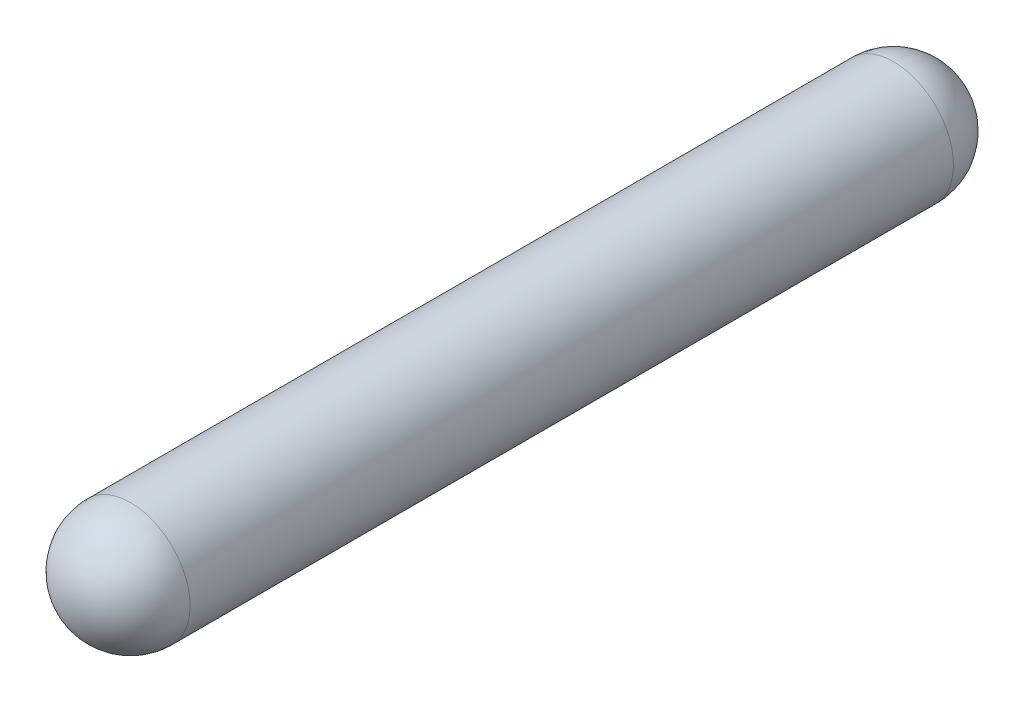
ISO-10303-21;
HEADER;
FILE_DESCRIPTION(('STEP AP214'),'2;1');
FILE_NAME('part.step','',(''),(''),'','','');
FILE_SCHEMA(('AUTOMOTIVE_DESIGN { 1 0 10303 214 1 1 1 1 }'));
ENDSEC;
DATA;
#1=APPLICATION_CONTEXT('core data for automotive mechanical design processes');
#2=APPLICATION_PROTOCOL_DEFINITION('international standard','automotive_design',2000,#1);
#3=PRODUCT_CONTEXT('',#1,'mechanical');
#4=PRODUCT('Part','Part','',(#3));
#5=PRODUCT_RELATED_PRODUCT_CATEGORY('part','',(#4));
#6=PRODUCT_DEFINITION_FORMATION('','',#4);
#7=PRODUCT_DEFINITION_CONTEXT('part definition',#1,'design');
#8=PRODUCT_DEFINITION('design','',#6,#7);
#9=PRODUCT_DEFINITION_SHAPE('','',#8);
#10=(LENGTH_UNIT() NAMED_UNIT(*) SI_UNIT(.MILLI.,.METRE.));
#11=(NAMED_UNIT(*) PLANE_ANGLE_UNIT() SI_UNIT($,.RADIAN.));
#12=(NAMED_UNIT(*) SI_UNIT($,.STERADIAN.) SOLID_ANGLE_UNIT());
#13=UNCERTAINTY_MEASURE_WITH_UNIT(LENGTH_MEASURE(1.E-05),#10,'distance_accuracy_value','');
#14=(GEOMETRIC_REPRESENTATION_CONTEXT(3) GLOBAL_UNCERTAINTY_ASSIGNED_CONTEXT((#13)) GLOBAL_UNIT_ASSIGNED_CONTEXT((#10,
#11,#12)) REPRESENTATION_CONTEXT('',''));
#15=CARTESIAN_POINT('',(0.,0.,0.));
#16=DIRECTION('',(0.,0.,1.));
#17=DIRECTION('',(1.,0.,0.));
#18=AXIS2_PLACEMENT_3D('',#15,#16,#17);
#19=CARTESIAN_POINT('',(0.,0.,-3.));
#20=DIRECTION('',(1.,0.,0.));
#21=DIRECTION('',(0.,-1.,0.));
#22=AXIS2_PLACEMENT_3D('',#19,#20,#21);
#23=SPHERICAL_SURFACE('',#22,0.712);
#24=CARTESIAN_POINT('',(0.,0.,-3.));
#25=DIRECTION('',(0.,0.,1.));
#26=DIRECTION('',(1.,0.,0.));
#27=AXIS2_PLACEMENT_3D('',#24,#25,#26);
#28=CIRCLE('',#27,0.712);
#29=CARTESIAN_POINT('',(0.712,0.,-3.));
#30=VERTEX_POINT('',#29);
#31=CARTESIAN_POINT('',(-0.712,0.,-3.));
#32=VERTEX_POINT('',#31);
#33=EDGE_CURVE('E41',#30,#32,#28,.T.);
#34=ORIENTED_EDGE('',*,*,#33,.F.);
#35=CARTESIAN_POINT('',(0.,0.,-3.));
#36=DIRECTION('',(0.,0.,1.));
#37=DIRECTION('',(1.,0.,0.));
#38=AXIS2_PLACEMENT_3D('',#35,#36,#37);
#39=CIRCLE('',#38,0.712);
#40=EDGE_CURVE('E25',#32,#30,#39,.T.);
#41=ORIENTED_EDGE('',*,*,#40,.F.);
#42=EDGE_LOOP('',(#34,#41));
#43=FACE_BOUND('',#42,.T.);
#44=ADVANCED_FACE('F16',(#43),#23,.T.);
#45=CARTESIAN_POINT('',(0.,0.,6.1));
#46=DIRECTION('',(1.,0.,0.));
#47=DIRECTION('',(0.,1.,0.));
#48=AXIS2_PLACEMENT_3D('',#45,#46,#47);
#49=SPHERICAL_SURFACE('',#48,0.712);
#50=CARTESIAN_POINT('',(0.,0.,6.1));
#51=DIRECTION('',(0.,0.,1.));
#52=DIRECTION('',(1.,0.,0.));
#53=AXIS2_PLACEMENT_3D('',#50,#51,#52);
#54=CIRCLE('',#53,0.712);
#55=CARTESIAN_POINT('',(0.712,0.,6.1));
#56=VERTEX_POINT('',#55);
#57=CARTESIAN_POINT('',(-0.712,0.,6.1));
#58=VERTEX_POINT('',#57);
#59=EDGE_CURVE('E11',#56,#58,#54,.F.);
#60=ORIENTED_EDGE('',*,*,#59,.F.);
#61=CARTESIAN_POINT('',(0.,0.,6.1));
#62=DIRECTION('',(0.,0.,1.));
#63=DIRECTION('',(1.,0.,0.));
#64=AXIS2_PLACEMENT_3D('',#61,#62,#63);
#65=CIRCLE('',#64,0.712);
#66=EDGE_CURVE('E33',#58,#56,#65,.F.);
#67=ORIENTED_EDGE('',*,*,#66,.F.);
#68=EDGE_LOOP('',(#60,#67));
#69=FACE_BOUND('',#68,.T.);
#70=ADVANCED_FACE('F48',(#69),#49,.T.);
#71=CARTESIAN_POINT('',(0.,0.,-3.));
#72=DIRECTION('',(0.,0.,1.));
#73=DIRECTION('',(1.,0.,0.));
#74=AXIS2_PLACEMENT_3D('',#71,#72,#73);
#75=CYLINDRICAL_SURFACE('',#74,0.712);
#76=ORIENTED_EDGE('',*,*,#66,.T.);
#77=ORIENTED_EDGE('',*,*,#59,.T.);
#78=EDGE_LOOP('',(#76,#77));
#79=FACE_BOUND('',#78,.T.);
#80=ORIENTED_EDGE('',*,*,#40,.T.);
#81=ORIENTED_EDGE('',*,*,#33,.T.);
#82=EDGE_LOOP('',(#80,#81));
#83=FACE_BOUND('',#82,.T.);
#84=ADVANCED_FACE('F44',(#79,#83),#75,.T.);
#85=CLOSED_SHELL('',(#44,#70,#84));
#86=MANIFOLD_SOLID_BREP('B1',#85);
#87=ADVANCED_BREP_SHAPE_REPRESENTATION('',(#18,#86),#14);
#88=SHAPE_DEFINITION_REPRESENTATION(#9,#87);
ENDSEC;
END-ISO-10303-21;
